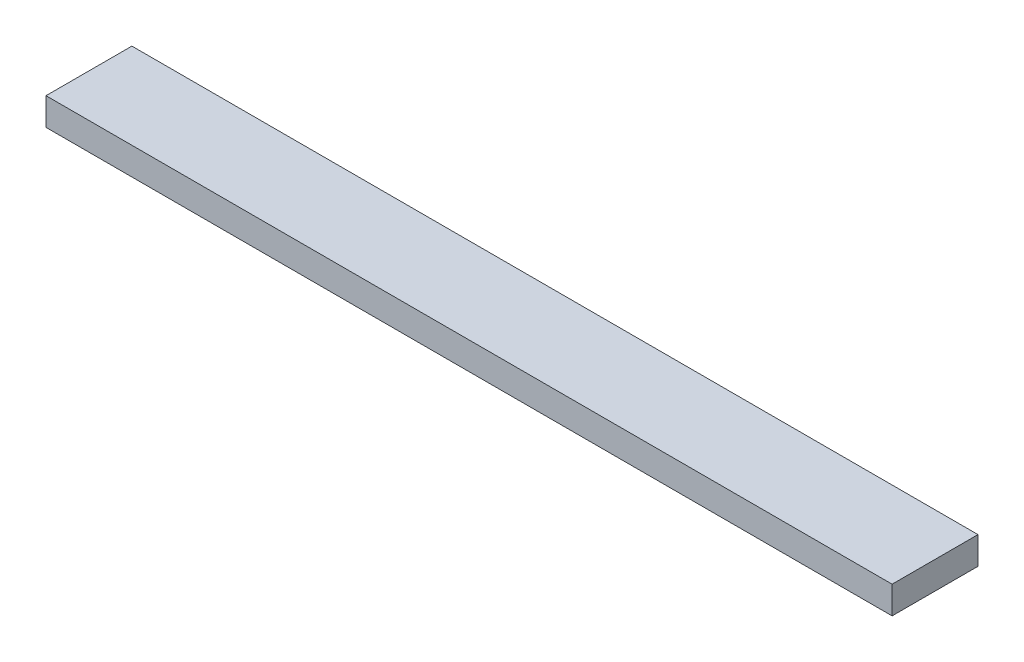
ISO-10303-21;
HEADER;
FILE_DESCRIPTION(('STEP AP214'),'2;1');
FILE_NAME('part.step','',(''),(''),'','','');
FILE_SCHEMA(('AUTOMOTIVE_DESIGN { 1 0 10303 214 1 1 1 1 }'));
ENDSEC;
DATA;
#1=APPLICATION_CONTEXT('core data for automotive mechanical design processes');
#2=APPLICATION_PROTOCOL_DEFINITION('international standard','automotive_design',2000,#1);
#3=PRODUCT_CONTEXT('',#1,'mechanical');
#4=PRODUCT('Part','Part','',(#3));
#5=PRODUCT_RELATED_PRODUCT_CATEGORY('part','',(#4));
#6=PRODUCT_DEFINITION_FORMATION('','',#4);
#7=PRODUCT_DEFINITION_CONTEXT('part definition',#1,'design');
#8=PRODUCT_DEFINITION('design','',#6,#7);
#9=PRODUCT_DEFINITION_SHAPE('','',#8);
#10=(LENGTH_UNIT() NAMED_UNIT(*) SI_UNIT(.MILLI.,.METRE.));
#11=(NAMED_UNIT(*) PLANE_ANGLE_UNIT() SI_UNIT($,.RADIAN.));
#12=(NAMED_UNIT(*) SI_UNIT($,.STERADIAN.) SOLID_ANGLE_UNIT());
#13=UNCERTAINTY_MEASURE_WITH_UNIT(LENGTH_MEASURE(1.E-05),#10,'distance_accuracy_value','');
#14=(GEOMETRIC_REPRESENTATION_CONTEXT(3) GLOBAL_UNCERTAINTY_ASSIGNED_CONTEXT((#13)) GLOBAL_UNIT_ASSIGNED_CONTEXT((#10,
#11,#12)) REPRESENTATION_CONTEXT('',''));
#15=CARTESIAN_POINT('',(0.,0.,0.));
#16=DIRECTION('',(0.,0.,1.));
#17=DIRECTION('',(1.,0.,0.));
#18=AXIS2_PLACEMENT_3D('',#15,#16,#17);
#19=CARTESIAN_POINT('',(-43.9163150492264,3.2,-11.5678621659634));
#20=DIRECTION('',(1.,0.,0.));
#21=DIRECTION('',(0.,0.,-1.));
#22=AXIS2_PLACEMENT_3D('',#19,#20,#21);
#23=PLANE('',#22);
#24=DIRECTION('',(0.,0.,1.));
#25=VECTOR('',#24,1.);
#26=CARTESIAN_POINT('',(-43.9163150492264,0.,-11.5678621659634));
#27=LINE('',#26,#25);
#28=CARTESIAN_POINT('',(-43.9163150492264,0.,-11.5678621659634));
#29=VERTEX_POINT('',#28);
#30=CARTESIAN_POINT('',(-43.9163150492264,0.,-1.56786216596342));
#31=VERTEX_POINT('',#30);
#32=EDGE_CURVE('E95',#29,#31,#27,.T.);
#33=ORIENTED_EDGE('',*,*,#32,.T.);
#34=DIRECTION('',(0.,-1.,0.));
#35=VECTOR('',#34,1.);
#36=CARTESIAN_POINT('',(-43.9163150492264,3.2,-1.56786216596342));
#37=LINE('',#36,#35);
#38=CARTESIAN_POINT('',(-43.9163150492264,3.2,-1.56786216596342));
#39=VERTEX_POINT('',#38);
#40=EDGE_CURVE('E11',#39,#31,#37,.T.);
#41=ORIENTED_EDGE('',*,*,#40,.F.);
#42=DIRECTION('',(0.,0.,1.));
#43=VECTOR('',#42,1.);
#44=CARTESIAN_POINT('',(-43.9163150492264,3.2,-11.5678621659634));
#45=LINE('',#44,#43);
#46=CARTESIAN_POINT('',(-43.9163150492264,3.2,-11.5678621659634));
#47=VERTEX_POINT('',#46);
#48=EDGE_CURVE('E83',#47,#39,#45,.T.);
#49=ORIENTED_EDGE('',*,*,#48,.F.);
#50=DIRECTION('',(0.,-1.,0.));
#51=VECTOR('',#50,1.);
#52=CARTESIAN_POINT('',(-43.9163150492264,3.2,-11.5678621659634));
#53=LINE('',#52,#51);
#54=EDGE_CURVE('E91',#47,#29,#53,.T.);
#55=ORIENTED_EDGE('',*,*,#54,.T.);
#56=EDGE_LOOP('',(#33,#41,#49,#55));
#57=FACE_BOUND('',#56,.T.);
#58=ADVANCED_FACE('F32',(#57),#23,.F.);
#59=CARTESIAN_POINT('',(-43.9163150492264,3.2,-1.56786216596342));
#60=DIRECTION('',(0.,0.,-1.));
#61=DIRECTION('',(-1.,0.,0.));
#62=AXIS2_PLACEMENT_3D('',#59,#60,#61);
#63=PLANE('',#62);
#64=DIRECTION('',(1.,0.,0.));
#65=VECTOR('',#64,1.);
#66=CARTESIAN_POINT('',(-43.9163150492264,0.,-1.56786216596342));
#67=LINE('',#66,#65);
#68=CARTESIAN_POINT('',(54.5836849507736,0.,-1.56786216596342));
#69=VERTEX_POINT('',#68);
#70=EDGE_CURVE('E87',#31,#69,#67,.T.);
#71=ORIENTED_EDGE('',*,*,#70,.T.);
#72=DIRECTION('',(0.,-1.,0.));
#73=VECTOR('',#72,1.);
#74=CARTESIAN_POINT('',(54.5836849507736,3.2,-1.56786216596342));
#75=LINE('',#74,#73);
#76=CARTESIAN_POINT('',(54.5836849507736,3.2,-1.56786216596342));
#77=VERTEX_POINT('',#76);
#78=EDGE_CURVE('E40',#77,#69,#75,.T.);
#79=ORIENTED_EDGE('',*,*,#78,.F.);
#80=DIRECTION('',(1.,0.,0.));
#81=VECTOR('',#80,1.);
#82=CARTESIAN_POINT('',(-43.9163150492264,3.2,-1.56786216596342));
#83=LINE('',#82,#81);
#84=EDGE_CURVE('E78',#39,#77,#83,.T.);
#85=ORIENTED_EDGE('',*,*,#84,.F.);
#86=ORIENTED_EDGE('',*,*,#40,.T.);
#87=EDGE_LOOP('',(#71,#79,#85,#86));
#88=FACE_BOUND('',#87,.T.);
#89=ADVANCED_FACE('F86',(#88),#63,.F.);
#90=CARTESIAN_POINT('',(54.5836849507736,3.2,-11.5678621659634));
#91=DIRECTION('',(-1.,0.,0.));
#92=DIRECTION('',(0.,0.,1.));
#93=AXIS2_PLACEMENT_3D('',#90,#91,#92);
#94=PLANE('',#93);
#95=DIRECTION('',(0.,0.,-1.));
#96=VECTOR('',#95,1.);
#97=CARTESIAN_POINT('',(54.5836849507736,0.,-11.5678621659634));
#98=LINE('',#97,#96);
#99=CARTESIAN_POINT('',(54.5836849507736,0.,-11.5678621659634));
#100=VERTEX_POINT('',#99);
#101=EDGE_CURVE('E65',#69,#100,#98,.T.);
#102=ORIENTED_EDGE('',*,*,#101,.T.);
#103=DIRECTION('',(0.,-1.,0.));
#104=VECTOR('',#103,1.);
#105=CARTESIAN_POINT('',(54.5836849507736,3.2,-11.5678621659634));
#106=LINE('',#105,#104);
#107=CARTESIAN_POINT('',(54.5836849507736,3.2,-11.5678621659634));
#108=VERTEX_POINT('',#107);
#109=EDGE_CURVE('E88',#108,#100,#106,.T.);
#110=ORIENTED_EDGE('',*,*,#109,.F.);
#111=DIRECTION('',(0.,0.,-1.));
#112=VECTOR('',#111,1.);
#113=CARTESIAN_POINT('',(54.5836849507736,3.2,-11.5678621659634));
#114=LINE('',#113,#112);
#115=EDGE_CURVE('E81',#77,#108,#114,.T.);
#116=ORIENTED_EDGE('',*,*,#115,.F.);
#117=ORIENTED_EDGE('',*,*,#78,.T.);
#118=EDGE_LOOP('',(#102,#110,#116,#117));
#119=FACE_BOUND('',#118,.T.);
#120=ADVANCED_FACE('F89',(#119),#94,.F.);
#121=CARTESIAN_POINT('',(-43.9163150492264,3.2,-11.5678621659634));
#122=DIRECTION('',(0.,0.,1.));
#123=DIRECTION('',(1.,0.,0.));
#124=AXIS2_PLACEMENT_3D('',#121,#122,#123);
#125=PLANE('',#124);
#126=DIRECTION('',(-1.,0.,0.));
#127=VECTOR('',#126,1.);
#128=CARTESIAN_POINT('',(-43.9163150492264,0.,-11.5678621659634));
#129=LINE('',#128,#127);
#130=EDGE_CURVE('E71',#100,#29,#129,.T.);
#131=ORIENTED_EDGE('',*,*,#130,.T.);
#132=ORIENTED_EDGE('',*,*,#54,.F.);
#133=DIRECTION('',(-1.,0.,0.));
#134=VECTOR('',#133,1.);
#135=CARTESIAN_POINT('',(-43.9163150492264,3.2,-11.5678621659634));
#136=LINE('',#135,#134);
#137=EDGE_CURVE('E48',#108,#47,#136,.T.);
#138=ORIENTED_EDGE('',*,*,#137,.F.);
#139=ORIENTED_EDGE('',*,*,#109,.T.);
#140=EDGE_LOOP('',(#131,#132,#138,#139));
#141=FACE_BOUND('',#140,.T.);
#142=ADVANCED_FACE('F102',(#141),#125,.F.);
#143=CARTESIAN_POINT('',(0.,3.2,0.));
#144=DIRECTION('',(0.,1.,0.));
#145=DIRECTION('',(0.,0.,1.));
#146=AXIS2_PLACEMENT_3D('',#143,#144,#145);
#147=PLANE('',#146);
#148=ORIENTED_EDGE('',*,*,#48,.T.);
#149=ORIENTED_EDGE('',*,*,#84,.T.);
#150=ORIENTED_EDGE('',*,*,#115,.T.);
#151=ORIENTED_EDGE('',*,*,#137,.T.);
#152=EDGE_LOOP('',(#148,#149,#150,#151));
#153=FACE_BOUND('',#152,.T.);
#154=ADVANCED_FACE('F79',(#153),#147,.T.);
#155=CARTESIAN_POINT('',(0.,0.,0.));
#156=DIRECTION('',(0.,1.,0.));
#157=DIRECTION('',(0.,0.,1.));
#158=AXIS2_PLACEMENT_3D('',#155,#156,#157);
#159=PLANE('',#158);
#160=ORIENTED_EDGE('',*,*,#32,.F.);
#161=ORIENTED_EDGE('',*,*,#130,.F.);
#162=ORIENTED_EDGE('',*,*,#101,.F.);
#163=ORIENTED_EDGE('',*,*,#70,.F.);
#164=EDGE_LOOP('',(#160,#161,#162,#163));
#165=FACE_BOUND('',#164,.T.);
#166=ADVANCED_FACE('F105',(#165),#159,.F.);
#167=CLOSED_SHELL('',(#58,#89,#120,#142,#154,#166));
#168=MANIFOLD_SOLID_BREP('B2',#167);
#169=ADVANCED_BREP_SHAPE_REPRESENTATION('',(#18,#168),#14);
#170=SHAPE_DEFINITION_REPRESENTATION(#9,#169);
ENDSEC;
END-ISO-10303-21;
